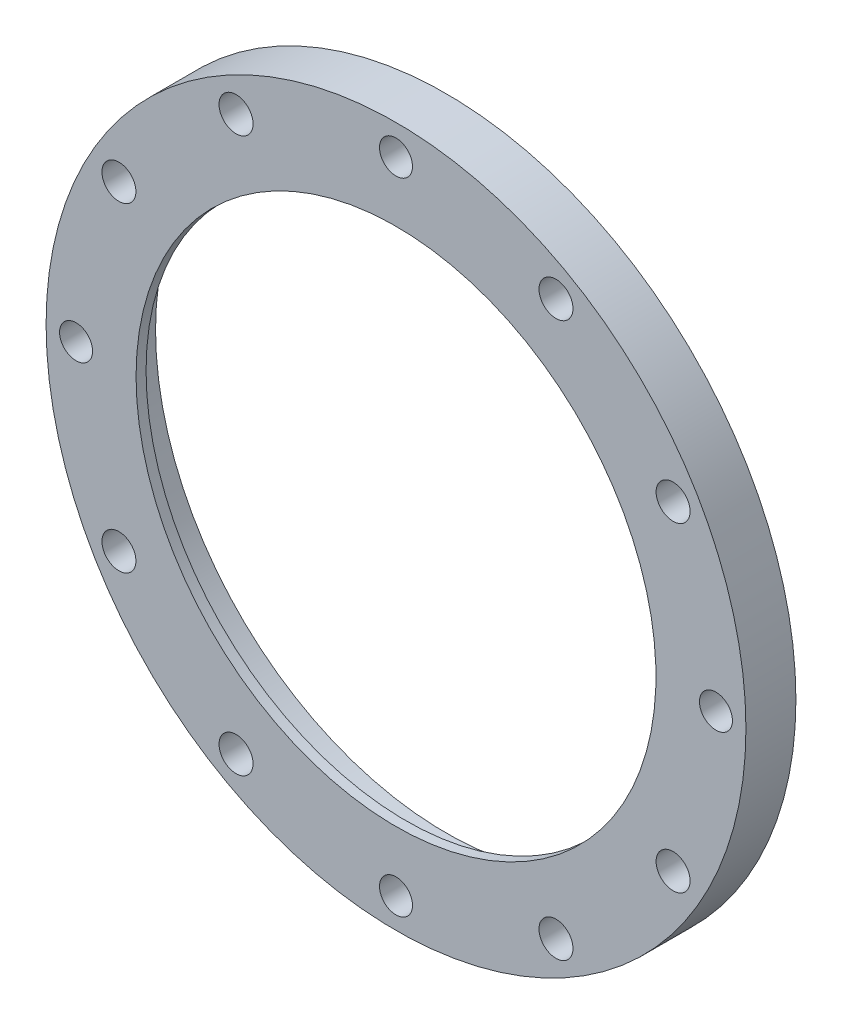
ISO-10303-21;
HEADER;
FILE_DESCRIPTION(('STEP AP214'),'2;1');
FILE_NAME('part.step','',(''),(''),'','','');
FILE_SCHEMA(('AUTOMOTIVE_DESIGN { 1 0 10303 214 1 1 1 1 }'));
ENDSEC;
DATA;
#1=APPLICATION_CONTEXT('core data for automotive mechanical design processes');
#2=APPLICATION_PROTOCOL_DEFINITION('international standard','automotive_design',2000,#1);
#3=PRODUCT_CONTEXT('',#1,'mechanical');
#4=PRODUCT('Part','Part','',(#3));
#5=PRODUCT_RELATED_PRODUCT_CATEGORY('part','',(#4));
#6=PRODUCT_DEFINITION_FORMATION('','',#4);
#7=PRODUCT_DEFINITION_CONTEXT('part definition',#1,'design');
#8=PRODUCT_DEFINITION('design','',#6,#7);
#9=PRODUCT_DEFINITION_SHAPE('','',#8);
#10=(LENGTH_UNIT() NAMED_UNIT(*) SI_UNIT(.MILLI.,.METRE.));
#11=(NAMED_UNIT(*) PLANE_ANGLE_UNIT() SI_UNIT($,.RADIAN.));
#12=(NAMED_UNIT(*) SI_UNIT($,.STERADIAN.) SOLID_ANGLE_UNIT());
#13=UNCERTAINTY_MEASURE_WITH_UNIT(LENGTH_MEASURE(1.E-05),#10,'distance_accuracy_value','');
#14=(GEOMETRIC_REPRESENTATION_CONTEXT(3) GLOBAL_UNCERTAINTY_ASSIGNED_CONTEXT((#13)) GLOBAL_UNIT_ASSIGNED_CONTEXT((#10,
#11,#12)) REPRESENTATION_CONTEXT('',''));
#15=CARTESIAN_POINT('',(0.,0.,0.));
#16=DIRECTION('',(0.,0.,1.));
#17=DIRECTION('',(1.,0.,0.));
#18=AXIS2_PLACEMENT_3D('',#15,#16,#17);
#19=CARTESIAN_POINT('',(0.,0.,-5.));
#20=DIRECTION('',(0.,0.,1.));
#21=DIRECTION('',(1.,0.,0.));
#22=AXIS2_PLACEMENT_3D('',#19,#20,#21);
#23=CYLINDRICAL_SURFACE('',#22,35.);
#24=CARTESIAN_POINT('',(0.,0.,-5.));
#25=DIRECTION('',(0.,0.,1.));
#26=DIRECTION('',(1.,0.,0.));
#27=AXIS2_PLACEMENT_3D('',#24,#25,#26);
#28=CIRCLE('',#27,35.);
#29=CARTESIAN_POINT('',(35.,0.,-5.));
#30=VERTEX_POINT('',#29);
#31=EDGE_CURVE('E10',#30,#30,#28,.T.);
#32=ORIENTED_EDGE('',*,*,#31,.T.);
#33=EDGE_LOOP('',(#32));
#34=FACE_BOUND('',#33,.T.);
#35=CARTESIAN_POINT('',(0.,0.,0.));
#36=DIRECTION('',(0.,0.,1.));
#37=DIRECTION('',(1.,0.,0.));
#38=AXIS2_PLACEMENT_3D('',#35,#36,#37);
#39=CIRCLE('',#38,35.);
#40=CARTESIAN_POINT('',(35.,0.,0.));
#41=VERTEX_POINT('',#40);
#42=EDGE_CURVE('E42',#41,#41,#39,.T.);
#43=ORIENTED_EDGE('',*,*,#42,.F.);
#44=EDGE_LOOP('',(#43));
#45=FACE_BOUND('',#44,.T.);
#46=ADVANCED_FACE('F35',(#34,#45),#23,.T.);
#47=CARTESIAN_POINT('',(35.,0.,-5.));
#48=DIRECTION('',(0.,0.,-1.));
#49=DIRECTION('',(-1.,0.,0.));
#50=AXIS2_PLACEMENT_3D('',#47,#48,#49);
#51=PLANE('',#50);
#52=CARTESIAN_POINT('',(-32.,0.,-5.));
#53=DIRECTION('',(0.,0.,-1.));
#54=DIRECTION('',(-1.,0.,0.));
#55=AXIS2_PLACEMENT_3D('',#52,#53,#54);
#56=CIRCLE('',#55,1.65);
#57=CARTESIAN_POINT('',(-33.65,0.,-5.));
#58=VERTEX_POINT('',#57);
#59=EDGE_CURVE('E55',#58,#58,#56,.T.);
#60=ORIENTED_EDGE('',*,*,#59,.F.);
#61=EDGE_LOOP('',(#60));
#62=FACE_BOUND('',#61,.T.);
#63=CARTESIAN_POINT('',(1.1172740284298E-13,-32.,-5.));
#64=DIRECTION('',(0.,0.,-1.));
#65=DIRECTION('',(-1.,0.,0.));
#66=AXIS2_PLACEMENT_3D('',#63,#64,#65);
#67=CIRCLE('',#66,1.65);
#68=CARTESIAN_POINT('',(-1.64999999999989,-32.,-5.));
#69=VERTEX_POINT('',#68);
#70=EDGE_CURVE('E208',#69,#69,#67,.T.);
#71=ORIENTED_EDGE('',*,*,#70,.F.);
#72=EDGE_LOOP('',(#71));
#73=FACE_BOUND('',#72,.T.);
#74=CARTESIAN_POINT('',(32.,2.23454805685961E-13,-5.));
#75=DIRECTION('',(0.,0.,-1.));
#76=DIRECTION('',(-1.,0.,0.));
#77=AXIS2_PLACEMENT_3D('',#74,#75,#76);
#78=CIRCLE('',#77,1.65);
#79=CARTESIAN_POINT('',(30.35,2.23454805685961E-13,-5.));
#80=VERTEX_POINT('',#79);
#81=EDGE_CURVE('E211',#80,#80,#78,.T.);
#82=ORIENTED_EDGE('',*,*,#81,.F.);
#83=EDGE_LOOP('',(#82));
#84=FACE_BOUND('',#83,.T.);
#85=CARTESIAN_POINT('',(-3.35182208528941E-13,32.,-5.));
#86=DIRECTION('',(0.,0.,-1.));
#87=DIRECTION('',(-1.,0.,0.));
#88=AXIS2_PLACEMENT_3D('',#85,#86,#87);
#89=CIRCLE('',#88,1.65);
#90=CARTESIAN_POINT('',(-1.65000000000034,32.,-5.));
#91=VERTEX_POINT('',#90);
#92=EDGE_CURVE('E74',#91,#91,#89,.T.);
#93=ORIENTED_EDGE('',*,*,#92,.F.);
#94=EDGE_LOOP('',(#93));
#95=FACE_BOUND('',#94,.T.);
#96=CARTESIAN_POINT('',(0.,0.,-5.));
#97=DIRECTION('',(0.,0.,-1.));
#98=DIRECTION('',(-1.,0.,0.));
#99=AXIS2_PLACEMENT_3D('',#96,#97,#98);
#100=CIRCLE('',#99,29.05);
#101=CARTESIAN_POINT('',(-29.05,0.,-5.));
#102=VERTEX_POINT('',#101);
#103=EDGE_CURVE('E62',#102,#102,#100,.T.);
#104=ORIENTED_EDGE('',*,*,#103,.F.);
#105=EDGE_LOOP('',(#104));
#106=FACE_BOUND('',#105,.T.);
#107=CARTESIAN_POINT('',(-16.,-27.712812921102,-5.));
#108=DIRECTION('',(0.,0.,-1.));
#109=DIRECTION('',(-1.,0.,0.));
#110=AXIS2_PLACEMENT_3D('',#107,#108,#109);
#111=CIRCLE('',#110,1.70000000000001);
#112=CARTESIAN_POINT('',(-17.7,-27.712812921102,-5.));
#113=VERTEX_POINT('',#112);
#114=EDGE_CURVE('E82',#113,#113,#111,.T.);
#115=ORIENTED_EDGE('',*,*,#114,.F.);
#116=EDGE_LOOP('',(#115));
#117=FACE_BOUND('',#116,.T.);
#118=CARTESIAN_POINT('',(16.,-27.712812921102,-5.));
#119=DIRECTION('',(0.,0.,-1.));
#120=DIRECTION('',(-1.,0.,0.));
#121=AXIS2_PLACEMENT_3D('',#118,#119,#120);
#122=CIRCLE('',#121,1.70000000000001);
#123=CARTESIAN_POINT('',(14.3,-27.712812921102,-5.));
#124=VERTEX_POINT('',#123);
#125=EDGE_CURVE('E88',#124,#124,#122,.T.);
#126=ORIENTED_EDGE('',*,*,#125,.F.);
#127=EDGE_LOOP('',(#126));
#128=FACE_BOUND('',#127,.T.);
#129=CARTESIAN_POINT('',(27.712812921102,-16.,-5.));
#130=DIRECTION('',(0.,0.,-1.));
#131=DIRECTION('',(-1.,0.,0.));
#132=AXIS2_PLACEMENT_3D('',#129,#130,#131);
#133=CIRCLE('',#132,1.70000000000001);
#134=CARTESIAN_POINT('',(26.012812921102,-16.,-5.));
#135=VERTEX_POINT('',#134);
#136=EDGE_CURVE('E94',#135,#135,#133,.T.);
#137=ORIENTED_EDGE('',*,*,#136,.F.);
#138=EDGE_LOOP('',(#137));
#139=FACE_BOUND('',#138,.T.);
#140=CARTESIAN_POINT('',(27.712812921102,16.,-5.));
#141=DIRECTION('',(0.,0.,-1.));
#142=DIRECTION('',(-1.,0.,0.));
#143=AXIS2_PLACEMENT_3D('',#140,#141,#142);
#144=CIRCLE('',#143,1.70000000000001);
#145=CARTESIAN_POINT('',(26.012812921102,16.,-5.));
#146=VERTEX_POINT('',#145);
#147=EDGE_CURVE('E100',#146,#146,#144,.T.);
#148=ORIENTED_EDGE('',*,*,#147,.F.);
#149=EDGE_LOOP('',(#148));
#150=FACE_BOUND('',#149,.T.);
#151=CARTESIAN_POINT('',(16.,27.712812921102,-5.));
#152=DIRECTION('',(0.,0.,-1.));
#153=DIRECTION('',(-1.,0.,0.));
#154=AXIS2_PLACEMENT_3D('',#151,#152,#153);
#155=CIRCLE('',#154,1.70000000000001);
#156=CARTESIAN_POINT('',(14.3,27.712812921102,-5.));
#157=VERTEX_POINT('',#156);
#158=EDGE_CURVE('E106',#157,#157,#155,.T.);
#159=ORIENTED_EDGE('',*,*,#158,.F.);
#160=EDGE_LOOP('',(#159));
#161=FACE_BOUND('',#160,.T.);
#162=CARTESIAN_POINT('',(-16.,27.712812921102,-5.));
#163=DIRECTION('',(0.,0.,-1.));
#164=DIRECTION('',(-1.,0.,0.));
#165=AXIS2_PLACEMENT_3D('',#162,#163,#164);
#166=CIRCLE('',#165,1.70000000000001);
#167=CARTESIAN_POINT('',(-17.7,27.712812921102,-5.));
#168=VERTEX_POINT('',#167);
#169=EDGE_CURVE('E112',#168,#168,#166,.T.);
#170=ORIENTED_EDGE('',*,*,#169,.F.);
#171=EDGE_LOOP('',(#170));
#172=FACE_BOUND('',#171,.T.);
#173=CARTESIAN_POINT('',(-27.712812921102,16.,-5.));
#174=DIRECTION('',(0.,0.,-1.));
#175=DIRECTION('',(-1.,0.,0.));
#176=AXIS2_PLACEMENT_3D('',#173,#174,#175);
#177=CIRCLE('',#176,1.70000000000001);
#178=CARTESIAN_POINT('',(-29.4128129211021,16.,-5.));
#179=VERTEX_POINT('',#178);
#180=EDGE_CURVE('E118',#179,#179,#177,.T.);
#181=ORIENTED_EDGE('',*,*,#180,.F.);
#182=EDGE_LOOP('',(#181));
#183=FACE_BOUND('',#182,.T.);
#184=CARTESIAN_POINT('',(-27.712812921102,-16.,-5.));
#185=DIRECTION('',(0.,0.,-1.));
#186=DIRECTION('',(-1.,0.,0.));
#187=AXIS2_PLACEMENT_3D('',#184,#185,#186);
#188=CIRCLE('',#187,1.70000000000001);
#189=CARTESIAN_POINT('',(-29.4128129211021,-16.,-5.));
#190=VERTEX_POINT('',#189);
#191=EDGE_CURVE('E124',#190,#190,#188,.T.);
#192=ORIENTED_EDGE('',*,*,#191,.F.);
#193=EDGE_LOOP('',(#192));
#194=FACE_BOUND('',#193,.T.);
#195=ORIENTED_EDGE('',*,*,#31,.F.);
#196=EDGE_LOOP('',(#195));
#197=FACE_BOUND('',#196,.T.);
#198=ADVANCED_FACE('F139',(#62,#73,#84,#95,#106,#117,#128,#139,#150,#161,#172,#183,#194,#197),
#51,.T.);
#199=CARTESIAN_POINT('',(0.,0.,0.));
#200=DIRECTION('',(0.,0.,1.));
#201=DIRECTION('',(1.,0.,0.));
#202=AXIS2_PLACEMENT_3D('',#199,#200,#201);
#203=PLANE('',#202);
#204=CARTESIAN_POINT('',(-32.,0.,0.));
#205=DIRECTION('',(0.,0.,1.));
#206=DIRECTION('',(1.,0.,0.));
#207=AXIS2_PLACEMENT_3D('',#204,#205,#206);
#208=CIRCLE('',#207,1.65);
#209=CARTESIAN_POINT('',(-30.35,0.,0.));
#210=VERTEX_POINT('',#209);
#211=EDGE_CURVE('E38',#210,#210,#208,.T.);
#212=ORIENTED_EDGE('',*,*,#211,.F.);
#213=EDGE_LOOP('',(#212));
#214=FACE_BOUND('',#213,.T.);
#215=CARTESIAN_POINT('',(1.1172740284298E-13,-32.,0.));
#216=DIRECTION('',(0.,0.,1.));
#217=DIRECTION('',(1.,0.,0.));
#218=AXIS2_PLACEMENT_3D('',#215,#216,#217);
#219=CIRCLE('',#218,1.65);
#220=CARTESIAN_POINT('',(1.65000000000011,-32.,0.));
#221=VERTEX_POINT('',#220);
#222=EDGE_CURVE('E57',#221,#221,#219,.T.);
#223=ORIENTED_EDGE('',*,*,#222,.F.);
#224=EDGE_LOOP('',(#223));
#225=FACE_BOUND('',#224,.T.);
#226=CARTESIAN_POINT('',(32.,2.23454805685961E-13,0.));
#227=DIRECTION('',(0.,0.,1.));
#228=DIRECTION('',(1.,0.,0.));
#229=AXIS2_PLACEMENT_3D('',#226,#227,#228);
#230=CIRCLE('',#229,1.65);
#231=CARTESIAN_POINT('',(33.65,2.23454805685961E-13,0.));
#232=VERTEX_POINT('',#231);
#233=EDGE_CURVE('E54',#232,#232,#230,.T.);
#234=ORIENTED_EDGE('',*,*,#233,.F.);
#235=EDGE_LOOP('',(#234));
#236=FACE_BOUND('',#235,.T.);
#237=CARTESIAN_POINT('',(-3.35182208528941E-13,32.,0.));
#238=DIRECTION('',(0.,0.,1.));
#239=DIRECTION('',(1.,0.,0.));
#240=AXIS2_PLACEMENT_3D('',#237,#238,#239);
#241=CIRCLE('',#240,1.65);
#242=CARTESIAN_POINT('',(1.64999999999967,32.,0.));
#243=VERTEX_POINT('',#242);
#244=EDGE_CURVE('E51',#243,#243,#241,.T.);
#245=ORIENTED_EDGE('',*,*,#244,.F.);
#246=EDGE_LOOP('',(#245));
#247=FACE_BOUND('',#246,.T.);
#248=CARTESIAN_POINT('',(0.,0.,0.));
#249=DIRECTION('',(0.,0.,-1.));
#250=DIRECTION('',(-1.,0.,0.));
#251=AXIS2_PLACEMENT_3D('',#248,#249,#250);
#252=CIRCLE('',#251,26.);
#253=CARTESIAN_POINT('',(-26.,0.,0.));
#254=VERTEX_POINT('',#253);
#255=EDGE_CURVE('E79',#254,#254,#252,.T.);
#256=ORIENTED_EDGE('',*,*,#255,.T.);
#257=EDGE_LOOP('',(#256));
#258=FACE_BOUND('',#257,.T.);
#259=CARTESIAN_POINT('',(-16.,-27.712812921102,0.));
#260=DIRECTION('',(0.,0.,-1.));
#261=DIRECTION('',(-1.,0.,0.));
#262=AXIS2_PLACEMENT_3D('',#259,#260,#261);
#263=CIRCLE('',#262,1.70000000000001);
#264=CARTESIAN_POINT('',(-17.7,-27.712812921102,0.));
#265=VERTEX_POINT('',#264);
#266=EDGE_CURVE('E85',#265,#265,#263,.T.);
#267=ORIENTED_EDGE('',*,*,#266,.T.);
#268=EDGE_LOOP('',(#267));
#269=FACE_BOUND('',#268,.T.);
#270=CARTESIAN_POINT('',(16.,-27.712812921102,0.));
#271=DIRECTION('',(0.,0.,-1.));
#272=DIRECTION('',(-1.,0.,0.));
#273=AXIS2_PLACEMENT_3D('',#270,#271,#272);
#274=CIRCLE('',#273,1.70000000000001);
#275=CARTESIAN_POINT('',(14.3,-27.712812921102,0.));
#276=VERTEX_POINT('',#275);
#277=EDGE_CURVE('E91',#276,#276,#274,.T.);
#278=ORIENTED_EDGE('',*,*,#277,.T.);
#279=EDGE_LOOP('',(#278));
#280=FACE_BOUND('',#279,.T.);
#281=CARTESIAN_POINT('',(27.712812921102,-16.,0.));
#282=DIRECTION('',(0.,0.,-1.));
#283=DIRECTION('',(-1.,0.,0.));
#284=AXIS2_PLACEMENT_3D('',#281,#282,#283);
#285=CIRCLE('',#284,1.70000000000001);
#286=CARTESIAN_POINT('',(26.012812921102,-16.,0.));
#287=VERTEX_POINT('',#286);
#288=EDGE_CURVE('E97',#287,#287,#285,.T.);
#289=ORIENTED_EDGE('',*,*,#288,.T.);
#290=EDGE_LOOP('',(#289));
#291=FACE_BOUND('',#290,.T.);
#292=CARTESIAN_POINT('',(27.712812921102,16.,0.));
#293=DIRECTION('',(0.,0.,-1.));
#294=DIRECTION('',(-1.,0.,0.));
#295=AXIS2_PLACEMENT_3D('',#292,#293,#294);
#296=CIRCLE('',#295,1.70000000000001);
#297=CARTESIAN_POINT('',(26.012812921102,16.,0.));
#298=VERTEX_POINT('',#297);
#299=EDGE_CURVE('E103',#298,#298,#296,.T.);
#300=ORIENTED_EDGE('',*,*,#299,.T.);
#301=EDGE_LOOP('',(#300));
#302=FACE_BOUND('',#301,.T.);
#303=CARTESIAN_POINT('',(16.,27.712812921102,0.));
#304=DIRECTION('',(0.,0.,-1.));
#305=DIRECTION('',(-1.,0.,0.));
#306=AXIS2_PLACEMENT_3D('',#303,#304,#305);
#307=CIRCLE('',#306,1.70000000000001);
#308=CARTESIAN_POINT('',(14.3,27.712812921102,0.));
#309=VERTEX_POINT('',#308);
#310=EDGE_CURVE('E109',#309,#309,#307,.T.);
#311=ORIENTED_EDGE('',*,*,#310,.T.);
#312=EDGE_LOOP('',(#311));
#313=FACE_BOUND('',#312,.T.);
#314=CARTESIAN_POINT('',(-16.,27.712812921102,0.));
#315=DIRECTION('',(0.,0.,-1.));
#316=DIRECTION('',(-1.,0.,0.));
#317=AXIS2_PLACEMENT_3D('',#314,#315,#316);
#318=CIRCLE('',#317,1.70000000000001);
#319=CARTESIAN_POINT('',(-17.7,27.712812921102,0.));
#320=VERTEX_POINT('',#319);
#321=EDGE_CURVE('E115',#320,#320,#318,.T.);
#322=ORIENTED_EDGE('',*,*,#321,.T.);
#323=EDGE_LOOP('',(#322));
#324=FACE_BOUND('',#323,.T.);
#325=CARTESIAN_POINT('',(-27.712812921102,16.,0.));
#326=DIRECTION('',(0.,0.,-1.));
#327=DIRECTION('',(-1.,0.,0.));
#328=AXIS2_PLACEMENT_3D('',#325,#326,#327);
#329=CIRCLE('',#328,1.70000000000001);
#330=CARTESIAN_POINT('',(-29.4128129211021,16.,0.));
#331=VERTEX_POINT('',#330);
#332=EDGE_CURVE('E121',#331,#331,#329,.T.);
#333=ORIENTED_EDGE('',*,*,#332,.T.);
#334=EDGE_LOOP('',(#333));
#335=FACE_BOUND('',#334,.T.);
#336=CARTESIAN_POINT('',(-27.712812921102,-16.,0.));
#337=DIRECTION('',(0.,0.,-1.));
#338=DIRECTION('',(-1.,0.,0.));
#339=AXIS2_PLACEMENT_3D('',#336,#337,#338);
#340=CIRCLE('',#339,1.70000000000001);
#341=CARTESIAN_POINT('',(-29.4128129211021,-16.,0.));
#342=VERTEX_POINT('',#341);
#343=EDGE_CURVE('E47',#342,#342,#340,.T.);
#344=ORIENTED_EDGE('',*,*,#343,.T.);
#345=EDGE_LOOP('',(#344));
#346=FACE_BOUND('',#345,.T.);
#347=ORIENTED_EDGE('',*,*,#42,.T.);
#348=EDGE_LOOP('',(#347));
#349=FACE_BOUND('',#348,.T.);
#350=ADVANCED_FACE('F129',(#214,#225,#236,#247,#258,#269,#280,#291,#302,#313,#324,#335,#346,
#349),#203,.T.);
#351=CARTESIAN_POINT('',(-27.712812921102,-16.,-5.));
#352=DIRECTION('',(0.,0.,-1.));
#353=DIRECTION('',(-1.,0.,0.));
#354=AXIS2_PLACEMENT_3D('',#351,#352,#353);
#355=CYLINDRICAL_SURFACE('',#354,1.70000000000001);
#356=ORIENTED_EDGE('',*,*,#343,.F.);
#357=EDGE_LOOP('',(#356));
#358=FACE_BOUND('',#357,.T.);
#359=ORIENTED_EDGE('',*,*,#191,.T.);
#360=EDGE_LOOP('',(#359));
#361=FACE_BOUND('',#360,.T.);
#362=ADVANCED_FACE('F132',(#358,#361),#355,.F.);
#363=CARTESIAN_POINT('',(-27.712812921102,16.,-5.));
#364=DIRECTION('',(0.,0.,-1.));
#365=DIRECTION('',(-1.,0.,0.));
#366=AXIS2_PLACEMENT_3D('',#363,#364,#365);
#367=CYLINDRICAL_SURFACE('',#366,1.70000000000001);
#368=ORIENTED_EDGE('',*,*,#332,.F.);
#369=EDGE_LOOP('',(#368));
#370=FACE_BOUND('',#369,.T.);
#371=ORIENTED_EDGE('',*,*,#180,.T.);
#372=EDGE_LOOP('',(#371));
#373=FACE_BOUND('',#372,.T.);
#374=ADVANCED_FACE('F135',(#370,#373),#367,.F.);
#375=CARTESIAN_POINT('',(-16.,27.712812921102,-5.));
#376=DIRECTION('',(0.,0.,-1.));
#377=DIRECTION('',(-1.,0.,0.));
#378=AXIS2_PLACEMENT_3D('',#375,#376,#377);
#379=CYLINDRICAL_SURFACE('',#378,1.70000000000001);
#380=ORIENTED_EDGE('',*,*,#321,.F.);
#381=EDGE_LOOP('',(#380));
#382=FACE_BOUND('',#381,.T.);
#383=ORIENTED_EDGE('',*,*,#169,.T.);
#384=EDGE_LOOP('',(#383));
#385=FACE_BOUND('',#384,.T.);
#386=ADVANCED_FACE('F154',(#382,#385),#379,.F.);
#387=CARTESIAN_POINT('',(16.,27.712812921102,-5.));
#388=DIRECTION('',(0.,0.,-1.));
#389=DIRECTION('',(-1.,0.,0.));
#390=AXIS2_PLACEMENT_3D('',#387,#388,#389);
#391=CYLINDRICAL_SURFACE('',#390,1.70000000000001);
#392=ORIENTED_EDGE('',*,*,#310,.F.);
#393=EDGE_LOOP('',(#392));
#394=FACE_BOUND('',#393,.T.);
#395=ORIENTED_EDGE('',*,*,#158,.T.);
#396=EDGE_LOOP('',(#395));
#397=FACE_BOUND('',#396,.T.);
#398=ADVANCED_FACE('F158',(#394,#397),#391,.F.);
#399=CARTESIAN_POINT('',(27.712812921102,16.,-5.));
#400=DIRECTION('',(0.,0.,-1.));
#401=DIRECTION('',(-1.,0.,0.));
#402=AXIS2_PLACEMENT_3D('',#399,#400,#401);
#403=CYLINDRICAL_SURFACE('',#402,1.70000000000001);
#404=ORIENTED_EDGE('',*,*,#299,.F.);
#405=EDGE_LOOP('',(#404));
#406=FACE_BOUND('',#405,.T.);
#407=ORIENTED_EDGE('',*,*,#147,.T.);
#408=EDGE_LOOP('',(#407));
#409=FACE_BOUND('',#408,.T.);
#410=ADVANCED_FACE('F162',(#406,#409),#403,.F.);
#411=CARTESIAN_POINT('',(27.712812921102,-16.,-5.));
#412=DIRECTION('',(0.,0.,-1.));
#413=DIRECTION('',(-1.,0.,0.));
#414=AXIS2_PLACEMENT_3D('',#411,#412,#413);
#415=CYLINDRICAL_SURFACE('',#414,1.70000000000001);
#416=ORIENTED_EDGE('',*,*,#288,.F.);
#417=EDGE_LOOP('',(#416));
#418=FACE_BOUND('',#417,.T.);
#419=ORIENTED_EDGE('',*,*,#136,.T.);
#420=EDGE_LOOP('',(#419));
#421=FACE_BOUND('',#420,.T.);
#422=ADVANCED_FACE('F166',(#418,#421),#415,.F.);
#423=CARTESIAN_POINT('',(16.,-27.712812921102,-5.));
#424=DIRECTION('',(0.,0.,-1.));
#425=DIRECTION('',(-1.,0.,0.));
#426=AXIS2_PLACEMENT_3D('',#423,#424,#425);
#427=CYLINDRICAL_SURFACE('',#426,1.70000000000001);
#428=ORIENTED_EDGE('',*,*,#277,.F.);
#429=EDGE_LOOP('',(#428));
#430=FACE_BOUND('',#429,.T.);
#431=ORIENTED_EDGE('',*,*,#125,.T.);
#432=EDGE_LOOP('',(#431));
#433=FACE_BOUND('',#432,.T.);
#434=ADVANCED_FACE('F170',(#430,#433),#427,.F.);
#435=CARTESIAN_POINT('',(-16.,-27.712812921102,-5.));
#436=DIRECTION('',(0.,0.,-1.));
#437=DIRECTION('',(-1.,0.,0.));
#438=AXIS2_PLACEMENT_3D('',#435,#436,#437);
#439=CYLINDRICAL_SURFACE('',#438,1.70000000000001);
#440=ORIENTED_EDGE('',*,*,#266,.F.);
#441=EDGE_LOOP('',(#440));
#442=FACE_BOUND('',#441,.T.);
#443=ORIENTED_EDGE('',*,*,#114,.T.);
#444=EDGE_LOOP('',(#443));
#445=FACE_BOUND('',#444,.T.);
#446=ADVANCED_FACE('F174',(#442,#445),#439,.F.);
#447=CARTESIAN_POINT('',(0.,0.,-5.));
#448=DIRECTION('',(0.,0.,-1.));
#449=DIRECTION('',(-1.,0.,0.));
#450=AXIS2_PLACEMENT_3D('',#447,#448,#449);
#451=CYLINDRICAL_SURFACE('',#450,26.);
#452=ORIENTED_EDGE('',*,*,#255,.F.);
#453=EDGE_LOOP('',(#452));
#454=FACE_BOUND('',#453,.T.);
#455=CARTESIAN_POINT('',(0.,0.,-0.999999999999997));
#456=DIRECTION('',(0.,0.,-1.));
#457=DIRECTION('',(-1.,0.,0.));
#458=AXIS2_PLACEMENT_3D('',#455,#456,#457);
#459=CIRCLE('',#458,26.);
#460=CARTESIAN_POINT('',(-26.,0.,-0.999999999999997));
#461=VERTEX_POINT('',#460);
#462=EDGE_CURVE('E71',#461,#461,#459,.T.);
#463=ORIENTED_EDGE('',*,*,#462,.T.);
#464=EDGE_LOOP('',(#463));
#465=FACE_BOUND('',#464,.T.);
#466=ADVANCED_FACE('F178',(#454,#465),#451,.F.);
#467=CARTESIAN_POINT('',(26.,0.,-0.999999999999998));
#468=DIRECTION('',(0.,0.,1.));
#469=DIRECTION('',(1.,0.,0.));
#470=AXIS2_PLACEMENT_3D('',#467,#468,#469);
#471=PLANE('',#470);
#472=ORIENTED_EDGE('',*,*,#462,.F.);
#473=EDGE_LOOP('',(#472));
#474=FACE_BOUND('',#473,.T.);
#475=CARTESIAN_POINT('',(0.,0.,-1.));
#476=DIRECTION('',(0.,0.,-1.));
#477=DIRECTION('',(-1.,0.,0.));
#478=AXIS2_PLACEMENT_3D('',#475,#476,#477);
#479=CIRCLE('',#478,29.05);
#480=CARTESIAN_POINT('',(-29.05,0.,-1.));
#481=VERTEX_POINT('',#480);
#482=EDGE_CURVE('E66',#481,#481,#479,.T.);
#483=ORIENTED_EDGE('',*,*,#482,.T.);
#484=EDGE_LOOP('',(#483));
#485=FACE_BOUND('',#484,.T.);
#486=ADVANCED_FACE('F182',(#474,#485),#471,.F.);
#487=CARTESIAN_POINT('',(0.,0.,-5.));
#488=DIRECTION('',(0.,0.,-1.));
#489=DIRECTION('',(-1.,0.,0.));
#490=AXIS2_PLACEMENT_3D('',#487,#488,#489);
#491=CYLINDRICAL_SURFACE('',#490,29.05);
#492=ORIENTED_EDGE('',*,*,#482,.F.);
#493=EDGE_LOOP('',(#492));
#494=FACE_BOUND('',#493,.T.);
#495=ORIENTED_EDGE('',*,*,#103,.T.);
#496=EDGE_LOOP('',(#495));
#497=FACE_BOUND('',#496,.T.);
#498=ADVANCED_FACE('F186',(#494,#497),#491,.F.);
#499=CARTESIAN_POINT('',(-3.35182208528941E-13,32.,5.));
#500=DIRECTION('',(0.,0.,-1.));
#501=DIRECTION('',(-1.,0.,0.));
#502=AXIS2_PLACEMENT_3D('',#499,#500,#501);
#503=CYLINDRICAL_SURFACE('',#502,1.65);
#504=ORIENTED_EDGE('',*,*,#244,.T.);
#505=EDGE_LOOP('',(#504));
#506=FACE_BOUND('',#505,.T.);
#507=ORIENTED_EDGE('',*,*,#92,.T.);
#508=EDGE_LOOP('',(#507));
#509=FACE_BOUND('',#508,.T.);
#510=ADVANCED_FACE('F190',(#506,#509),#503,.F.);
#511=CARTESIAN_POINT('',(32.,2.23454805685961E-13,5.));
#512=DIRECTION('',(0.,0.,-1.));
#513=DIRECTION('',(-1.,0.,0.));
#514=AXIS2_PLACEMENT_3D('',#511,#512,#513);
#515=CYLINDRICAL_SURFACE('',#514,1.65);
#516=ORIENTED_EDGE('',*,*,#233,.T.);
#517=EDGE_LOOP('',(#516));
#518=FACE_BOUND('',#517,.T.);
#519=ORIENTED_EDGE('',*,*,#81,.T.);
#520=EDGE_LOOP('',(#519));
#521=FACE_BOUND('',#520,.T.);
#522=ADVANCED_FACE('F194',(#518,#521),#515,.F.);
#523=CARTESIAN_POINT('',(1.1172740284298E-13,-32.,5.));
#524=DIRECTION('',(0.,0.,-1.));
#525=DIRECTION('',(-1.,0.,0.));
#526=AXIS2_PLACEMENT_3D('',#523,#524,#525);
#527=CYLINDRICAL_SURFACE('',#526,1.65);
#528=ORIENTED_EDGE('',*,*,#222,.T.);
#529=EDGE_LOOP('',(#528));
#530=FACE_BOUND('',#529,.T.);
#531=ORIENTED_EDGE('',*,*,#70,.T.);
#532=EDGE_LOOP('',(#531));
#533=FACE_BOUND('',#532,.T.);
#534=ADVANCED_FACE('F198',(#530,#533),#527,.F.);
#535=CARTESIAN_POINT('',(-32.,0.,5.));
#536=DIRECTION('',(0.,0.,-1.));
#537=DIRECTION('',(-1.,0.,0.));
#538=AXIS2_PLACEMENT_3D('',#535,#536,#537);
#539=CYLINDRICAL_SURFACE('',#538,1.65);
#540=ORIENTED_EDGE('',*,*,#211,.T.);
#541=EDGE_LOOP('',(#540));
#542=FACE_BOUND('',#541,.T.);
#543=ORIENTED_EDGE('',*,*,#59,.T.);
#544=EDGE_LOOP('',(#543));
#545=FACE_BOUND('',#544,.T.);
#546=ADVANCED_FACE('F202',(#542,#545),#539,.F.);
#547=CLOSED_SHELL('',(#46,#198,#350,#362,#374,#386,#398,#410,#422,#434,#446,#466,#486,#498,#510,
#522,#534,#546));
#548=MANIFOLD_SOLID_BREP('B2',#547);
#549=ADVANCED_BREP_SHAPE_REPRESENTATION('',(#18,#548),#14);
#550=SHAPE_DEFINITION_REPRESENTATION(#9,#549);
ENDSEC;
END-ISO-10303-21;
